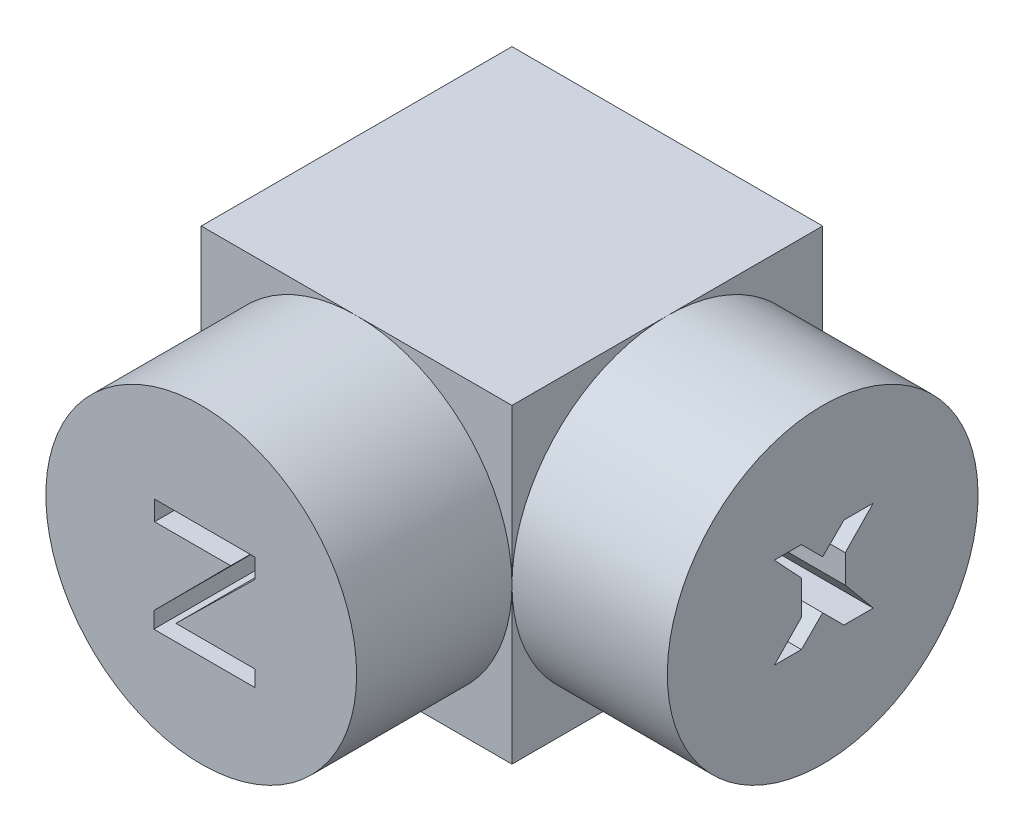
ISO-10303-21;
HEADER;
FILE_DESCRIPTION(('STEP AP214'),'2;1');
FILE_NAME('part.step','',(''),(''),'','','');
FILE_SCHEMA(('AUTOMOTIVE_DESIGN { 1 0 10303 214 1 1 1 1 }'));
ENDSEC;
DATA;
#1=APPLICATION_CONTEXT('core data for automotive mechanical design processes');
#2=APPLICATION_PROTOCOL_DEFINITION('international standard','automotive_design',2000,#1);
#3=PRODUCT_CONTEXT('',#1,'mechanical');
#4=PRODUCT('Part','Part','',(#3));
#5=PRODUCT_RELATED_PRODUCT_CATEGORY('part','',(#4));
#6=PRODUCT_DEFINITION_FORMATION('','',#4);
#7=PRODUCT_DEFINITION_CONTEXT('part definition',#1,'design');
#8=PRODUCT_DEFINITION('design','',#6,#7);
#9=PRODUCT_DEFINITION_SHAPE('','',#8);
#10=(LENGTH_UNIT() NAMED_UNIT(*) SI_UNIT(.MILLI.,.METRE.));
#11=(NAMED_UNIT(*) PLANE_ANGLE_UNIT() SI_UNIT($,.RADIAN.));
#12=(NAMED_UNIT(*) SI_UNIT($,.STERADIAN.) SOLID_ANGLE_UNIT());
#13=UNCERTAINTY_MEASURE_WITH_UNIT(LENGTH_MEASURE(1.E-05),#10,'distance_accuracy_value','');
#14=(GEOMETRIC_REPRESENTATION_CONTEXT(3) GLOBAL_UNCERTAINTY_ASSIGNED_CONTEXT((#13)) GLOBAL_UNIT_ASSIGNED_CONTEXT((#10,
#11,#12)) REPRESENTATION_CONTEXT('',''));
#15=CARTESIAN_POINT('',(0.,0.,0.));
#16=DIRECTION('',(0.,0.,1.));
#17=DIRECTION('',(1.,0.,0.));
#18=AXIS2_PLACEMENT_3D('',#15,#16,#17);
#19=CARTESIAN_POINT('',(0.025,0.0249999999999998,-0.025));
#20=DIRECTION('',(1.,0.,0.));
#21=DIRECTION('',(0.,1.,0.));
#22=AXIS2_PLACEMENT_3D('',#19,#20,#21);
#23=PLANE('',#22);
#24=DIRECTION('',(0.,0.,1.));
#25=VECTOR('',#24,1.);
#26=CARTESIAN_POINT('',(0.025,0.0249999999999998,-0.025));
#27=LINE('',#26,#25);
#28=CARTESIAN_POINT('',(0.025,0.0249999999999998,-0.025));
#29=VERTEX_POINT('',#28);
#30=CARTESIAN_POINT('',(0.025,0.0249999999999998,0.));
#31=VERTEX_POINT('',#30);
#32=EDGE_CURVE('E462',#29,#31,#27,.T.);
#33=ORIENTED_EDGE('',*,*,#32,.T.);
#34=CARTESIAN_POINT('',(0.025,0.,0.));
#35=DIRECTION('',(1.,0.,0.));
#36=DIRECTION('',(0.,1.,0.));
#37=AXIS2_PLACEMENT_3D('',#34,#35,#36);
#38=CIRCLE('',#37,0.0249999999999998);
#39=CARTESIAN_POINT('',(0.025,0.,-0.025));
#40=VERTEX_POINT('',#39);
#41=EDGE_CURVE('E254',#40,#31,#38,.T.);
#42=ORIENTED_EDGE('',*,*,#41,.F.);
#43=DIRECTION('',(0.,1.,0.));
#44=VECTOR('',#43,1.);
#45=CARTESIAN_POINT('',(0.025,0.0249999999999998,-0.025));
#46=LINE('',#45,#44);
#47=EDGE_CURVE('E452',#40,#29,#46,.T.);
#48=ORIENTED_EDGE('',*,*,#47,.T.);
#49=EDGE_LOOP('',(#33,#42,#48));
#50=FACE_BOUND('',#49,.T.);
#51=ADVANCED_FACE('F31',(#50),#23,.T.);
#52=CARTESIAN_POINT('',(0.025,-0.0249999999999998,-0.025));
#53=VERTEX_POINT('',#52);
#54=EDGE_CURVE('E453',#53,#40,#46,.T.);
#55=ORIENTED_EDGE('',*,*,#54,.T.);
#56=CARTESIAN_POINT('',(0.025,-0.0249999999999998,0.));
#57=VERTEX_POINT('',#56);
#58=EDGE_CURVE('E512',#57,#40,#38,.T.);
#59=ORIENTED_EDGE('',*,*,#58,.F.);
#60=DIRECTION('',(0.,0.,1.));
#61=VECTOR('',#60,1.);
#62=CARTESIAN_POINT('',(0.025,-0.0249999999999998,-0.025));
#63=LINE('',#62,#61);
#64=EDGE_CURVE('E465',#53,#57,#63,.T.);
#65=ORIENTED_EDGE('',*,*,#64,.F.);
#66=EDGE_LOOP('',(#55,#59,#65));
#67=FACE_BOUND('',#66,.T.);
#68=ADVANCED_FACE('F511',(#67),#23,.T.);
#69=CARTESIAN_POINT('',(0.025,-0.0249999999999998,0.025));
#70=VERTEX_POINT('',#69);
#71=EDGE_CURVE('E467',#57,#70,#63,.T.);
#72=ORIENTED_EDGE('',*,*,#71,.F.);
#73=CARTESIAN_POINT('',(0.0250011786662926,0.,0.0250011786662925));
#74=VERTEX_POINT('',#73);
#75=EDGE_CURVE('E353',#74,#57,#38,.T.);
#76=ORIENTED_EDGE('',*,*,#75,.F.);
#77=DIRECTION('',(0.,1.,0.));
#78=VECTOR('',#77,1.);
#79=CARTESIAN_POINT('',(0.025,0.0249999999999998,0.025));
#80=LINE('',#79,#78);
#81=EDGE_CURVE('E439',#70,#74,#80,.T.);
#82=ORIENTED_EDGE('',*,*,#81,.F.);
#83=EDGE_LOOP('',(#72,#76,#82));
#84=FACE_BOUND('',#83,.T.);
#85=ADVANCED_FACE('F517',(#84),#23,.T.);
#86=CARTESIAN_POINT('',(0.025,0.0249999999999998,0.025));
#87=VERTEX_POINT('',#86);
#88=EDGE_CURVE('E438',#74,#87,#80,.T.);
#89=ORIENTED_EDGE('',*,*,#88,.F.);
#90=EDGE_CURVE('E351',#31,#74,#38,.T.);
#91=ORIENTED_EDGE('',*,*,#90,.F.);
#92=EDGE_CURVE('E464',#31,#87,#27,.T.);
#93=ORIENTED_EDGE('',*,*,#92,.T.);
#94=EDGE_LOOP('',(#89,#91,#93));
#95=FACE_BOUND('',#94,.T.);
#96=ADVANCED_FACE('F500',(#95),#23,.T.);
#97=CARTESIAN_POINT('',(-0.025,-0.0249999999999998,0.025));
#98=DIRECTION('',(0.,0.,1.));
#99=DIRECTION('',(1.,0.,0.));
#100=AXIS2_PLACEMENT_3D('',#97,#98,#99);
#101=PLANE('',#100);
#102=CARTESIAN_POINT('',(0.,0.,0.025));
#103=DIRECTION('',(0.,0.,1.));
#104=DIRECTION('',(1.,0.,0.));
#105=AXIS2_PLACEMENT_3D('',#102,#103,#104);
#106=CIRCLE('',#105,0.0250047146651704);
#107=CARTESIAN_POINT('',(0.,0.0249999999999998,0.025));
#108=VERTEX_POINT('',#107);
#109=EDGE_CURVE('E42',#74,#108,#106,.T.);
#110=ORIENTED_EDGE('',*,*,#109,.F.);
#111=ORIENTED_EDGE('',*,*,#88,.T.);
#112=DIRECTION('',(-1.,0.,0.));
#113=VECTOR('',#112,1.);
#114=CARTESIAN_POINT('',(-0.025,0.0249999999999998,0.025));
#115=LINE('',#114,#113);
#116=EDGE_CURVE('E443',#87,#108,#115,.T.);
#117=ORIENTED_EDGE('',*,*,#116,.T.);
#118=EDGE_LOOP('',(#110,#111,#117));
#119=FACE_BOUND('',#118,.T.);
#120=ADVANCED_FACE('F496',(#119),#101,.T.);
#121=CARTESIAN_POINT('',(-0.025,0.,0.025));
#122=VERTEX_POINT('',#121);
#123=EDGE_CURVE('E11',#108,#122,#106,.T.);
#124=ORIENTED_EDGE('',*,*,#123,.F.);
#125=CARTESIAN_POINT('',(-0.025,0.0249999999999998,0.025));
#126=VERTEX_POINT('',#125);
#127=EDGE_CURVE('E442',#108,#126,#115,.T.);
#128=ORIENTED_EDGE('',*,*,#127,.T.);
#129=DIRECTION('',(0.,-1.,0.));
#130=VECTOR('',#129,1.);
#131=CARTESIAN_POINT('',(-0.025,0.0249999999999998,0.025));
#132=LINE('',#131,#130);
#133=EDGE_CURVE('E431',#126,#122,#132,.T.);
#134=ORIENTED_EDGE('',*,*,#133,.T.);
#135=EDGE_LOOP('',(#124,#128,#134));
#136=FACE_BOUND('',#135,.T.);
#137=ADVANCED_FACE('F489',(#136),#101,.T.);
#138=CARTESIAN_POINT('',(0.,-0.0249999999999998,0.025));
#139=VERTEX_POINT('',#138);
#140=EDGE_CURVE('E40',#122,#139,#106,.T.);
#141=ORIENTED_EDGE('',*,*,#140,.F.);
#142=CARTESIAN_POINT('',(-0.025,-0.0249999999999998,0.025));
#143=VERTEX_POINT('',#142);
#144=EDGE_CURVE('E427',#122,#143,#132,.T.);
#145=ORIENTED_EDGE('',*,*,#144,.T.);
#146=DIRECTION('',(1.,0.,0.));
#147=VECTOR('',#146,1.);
#148=CARTESIAN_POINT('',(-0.025,-0.0249999999999998,0.025));
#149=LINE('',#148,#147);
#150=EDGE_CURVE('E435',#143,#139,#149,.T.);
#151=ORIENTED_EDGE('',*,*,#150,.T.);
#152=EDGE_LOOP('',(#141,#145,#151));
#153=FACE_BOUND('',#152,.T.);
#154=ADVANCED_FACE('F482',(#153),#101,.T.);
#155=CARTESIAN_POINT('',(-0.025,0.0249999999999998,-0.025));
#156=DIRECTION('',(-1.,0.,0.));
#157=DIRECTION('',(0.,-1.,0.));
#158=AXIS2_PLACEMENT_3D('',#155,#156,#157);
#159=PLANE('',#158);
#160=DIRECTION('',(0.,0.,1.));
#161=VECTOR('',#160,1.);
#162=CARTESIAN_POINT('',(-0.025,-0.0249999999999998,-0.025));
#163=LINE('',#162,#161);
#164=CARTESIAN_POINT('',(-0.025,-0.0249999999999998,-0.025));
#165=VERTEX_POINT('',#164);
#166=EDGE_CURVE('E35',#165,#143,#163,.T.);
#167=ORIENTED_EDGE('',*,*,#166,.T.);
#168=ORIENTED_EDGE('',*,*,#144,.F.);
#169=ORIENTED_EDGE('',*,*,#133,.F.);
#170=DIRECTION('',(0.,0.,1.));
#171=VECTOR('',#170,1.);
#172=CARTESIAN_POINT('',(-0.025,0.0249999999999998,-0.025));
#173=LINE('',#172,#171);
#174=CARTESIAN_POINT('',(-0.025,0.0249999999999998,-0.025));
#175=VERTEX_POINT('',#174);
#176=EDGE_CURVE('E459',#175,#126,#173,.T.);
#177=ORIENTED_EDGE('',*,*,#176,.F.);
#178=DIRECTION('',(0.,-1.,0.));
#179=VECTOR('',#178,1.);
#180=CARTESIAN_POINT('',(-0.025,0.0249999999999998,-0.025));
#181=LINE('',#180,#179);
#182=EDGE_CURVE('E446',#175,#165,#181,.T.);
#183=ORIENTED_EDGE('',*,*,#182,.T.);
#184=EDGE_LOOP('',(#167,#168,#169,#177,#183));
#185=FACE_BOUND('',#184,.T.);
#186=ADVANCED_FACE('F33',(#185),#159,.T.);
#187=CARTESIAN_POINT('',(-0.025,0.0249999999999998,-0.025));
#188=DIRECTION('',(0.,1.,0.));
#189=DIRECTION('',(0.,0.,1.));
#190=AXIS2_PLACEMENT_3D('',#187,#188,#189);
#191=PLANE('',#190);
#192=ORIENTED_EDGE('',*,*,#176,.T.);
#193=ORIENTED_EDGE('',*,*,#127,.F.);
#194=ORIENTED_EDGE('',*,*,#116,.F.);
#195=ORIENTED_EDGE('',*,*,#92,.F.);
#196=ORIENTED_EDGE('',*,*,#32,.F.);
#197=DIRECTION('',(-1.,0.,0.));
#198=VECTOR('',#197,1.);
#199=CARTESIAN_POINT('',(-0.025,0.0249999999999998,-0.025));
#200=LINE('',#199,#198);
#201=EDGE_CURVE('E456',#29,#175,#200,.T.);
#202=ORIENTED_EDGE('',*,*,#201,.T.);
#203=EDGE_LOOP('',(#192,#193,#194,#195,#196,#202));
#204=FACE_BOUND('',#203,.T.);
#205=ADVANCED_FACE('F492',(#204),#191,.T.);
#206=CARTESIAN_POINT('',(-0.025,-0.0249999999999998,-0.025));
#207=DIRECTION('',(0.,-1.,0.));
#208=DIRECTION('',(0.,0.,-1.));
#209=AXIS2_PLACEMENT_3D('',#206,#207,#208);
#210=PLANE('',#209);
#211=ORIENTED_EDGE('',*,*,#64,.T.);
#212=ORIENTED_EDGE('',*,*,#71,.T.);
#213=EDGE_CURVE('E434',#139,#70,#149,.T.);
#214=ORIENTED_EDGE('',*,*,#213,.F.);
#215=ORIENTED_EDGE('',*,*,#150,.F.);
#216=ORIENTED_EDGE('',*,*,#166,.F.);
#217=DIRECTION('',(1.,0.,0.));
#218=VECTOR('',#217,1.);
#219=CARTESIAN_POINT('',(-0.025,-0.0249999999999998,-0.025));
#220=LINE('',#219,#218);
#221=EDGE_CURVE('E449',#165,#53,#220,.T.);
#222=ORIENTED_EDGE('',*,*,#221,.T.);
#223=EDGE_LOOP('',(#211,#212,#214,#215,#216,#222));
#224=FACE_BOUND('',#223,.T.);
#225=ADVANCED_FACE('F479',(#224),#210,.T.);
#226=CARTESIAN_POINT('',(-0.025,-0.0249999999999998,-0.025));
#227=DIRECTION('',(0.,0.,1.));
#228=DIRECTION('',(1.,0.,0.));
#229=AXIS2_PLACEMENT_3D('',#226,#227,#228);
#230=PLANE('',#229);
#231=ORIENTED_EDGE('',*,*,#182,.F.);
#232=ORIENTED_EDGE('',*,*,#201,.F.);
#233=ORIENTED_EDGE('',*,*,#47,.F.);
#234=ORIENTED_EDGE('',*,*,#54,.F.);
#235=ORIENTED_EDGE('',*,*,#221,.F.);
#236=EDGE_LOOP('',(#231,#232,#233,#234,#235));
#237=FACE_BOUND('',#236,.T.);
#238=ADVANCED_FACE('F508',(#237),#230,.F.);
#239=EDGE_CURVE('E430',#139,#74,#106,.T.);
#240=ORIENTED_EDGE('',*,*,#239,.F.);
#241=ORIENTED_EDGE('',*,*,#213,.T.);
#242=ORIENTED_EDGE('',*,*,#81,.T.);
#243=EDGE_LOOP('',(#240,#241,#242));
#244=FACE_BOUND('',#243,.T.);
#245=ADVANCED_FACE('F519',(#244),#101,.T.);
#246=CARTESIAN_POINT('',(0.,0.,0.05));
#247=DIRECTION('',(0.,0.,1.));
#248=DIRECTION('',(1.,0.,0.));
#249=AXIS2_PLACEMENT_3D('',#246,#247,#248);
#250=PLANE('',#249);
#251=CARTESIAN_POINT('',(0.,0.,0.05));
#252=DIRECTION('',(0.,0.,1.));
#253=DIRECTION('',(1.,0.,0.));
#254=AXIS2_PLACEMENT_3D('',#251,#252,#253);
#255=CIRCLE('',#254,0.0250047146651704);
#256=CARTESIAN_POINT('',(0.0250047146651704,0.,0.05));
#257=VERTEX_POINT('',#256);
#258=EDGE_CURVE('E425',#257,#257,#255,.T.);
#259=ORIENTED_EDGE('',*,*,#258,.T.);
#260=EDGE_LOOP('',(#259));
#261=FACE_BOUND('',#260,.T.);
#262=DIRECTION('',(1.,0.,0.));
#263=VECTOR('',#262,1.);
#264=CARTESIAN_POINT('',(0.00472598676449805,0.00502520446407785,0.05));
#265=LINE('',#264,#263);
#266=CARTESIAN_POINT('',(-0.00750978718742156,0.00502520446407785,0.05));
#267=VERTEX_POINT('',#266);
#268=CARTESIAN_POINT('',(0.00472598676449805,0.00502520446407785,0.05));
#269=VERTEX_POINT('',#268);
#270=EDGE_CURVE('E356',#267,#269,#265,.T.);
#271=ORIENTED_EDGE('',*,*,#270,.F.);
#272=DIRECTION('',(0.,-1.,0.));
#273=VECTOR('',#272,1.);
#274=CARTESIAN_POINT('',(-0.00750978718742156,0.00502520446407785,0.05));
#275=LINE('',#274,#273);
#276=CARTESIAN_POINT('',(-0.00750978718742156,0.00818955240697282,0.05));
#277=VERTEX_POINT('',#276);
#278=EDGE_CURVE('E354',#277,#267,#275,.T.);
#279=ORIENTED_EDGE('',*,*,#278,.F.);
#280=DIRECTION('',(-1.,0.,0.));
#281=VECTOR('',#280,1.);
#282=CARTESIAN_POINT('',(-0.00750978718742156,0.00818955240697282,0.05));
#283=LINE('',#282,#281);
#284=CARTESIAN_POINT('',(0.00861035944764713,0.00818955240697282,0.05));
#285=VERTEX_POINT('',#284);
#286=EDGE_CURVE('E374',#285,#277,#283,.T.);
#287=ORIENTED_EDGE('',*,*,#286,.F.);
#288=DIRECTION('',(0.,1.,0.));
#289=VECTOR('',#288,1.);
#290=CARTESIAN_POINT('',(0.00861035944764713,0.00818955240697282,0.05));
#291=LINE('',#290,#289);
#292=CARTESIAN_POINT('',(0.00861035944764713,0.00502520446407785,0.05));
#293=VERTEX_POINT('',#292);
#294=EDGE_CURVE('E371',#293,#285,#291,.T.);
#295=ORIENTED_EDGE('',*,*,#294,.F.);
#296=DIRECTION('',(0.714136574352268,0.700006395093936,0.));
#297=VECTOR('',#296,1.);
#298=CARTESIAN_POINT('',(0.00861035944764713,0.00502520446407785,0.05));
#299=LINE('',#298,#297);
#300=CARTESIAN_POINT('',(-0.00407859131730653,-0.00741267787034266,0.05));
#301=VERTEX_POINT('',#300);
#302=EDGE_CURVE('E369',#301,#293,#299,.T.);
#303=ORIENTED_EDGE('',*,*,#302,.F.);
#304=DIRECTION('',(-1.,0.,0.));
#305=VECTOR('',#304,1.);
#306=CARTESIAN_POINT('',(-0.00407859131730653,-0.00741267787034266,0.05));
#307=LINE('',#306,#305);
#308=CARTESIAN_POINT('',(0.00861035944764713,-0.00741267787034266,0.05));
#309=VERTEX_POINT('',#308);
#310=EDGE_CURVE('E367',#309,#301,#307,.T.);
#311=ORIENTED_EDGE('',*,*,#310,.F.);
#312=DIRECTION('',(0.,1.,0.));
#313=VECTOR('',#312,1.);
#314=CARTESIAN_POINT('',(0.00861035944764713,-0.00741267787034266,0.05));
#315=LINE('',#314,#313);
#316=CARTESIAN_POINT('',(0.00861035944764713,-0.0100022596591087,0.05));
#317=VERTEX_POINT('',#316);
#318=EDGE_CURVE('E365',#317,#309,#315,.T.);
#319=ORIENTED_EDGE('',*,*,#318,.F.);
#320=DIRECTION('',(1.,0.,0.));
#321=VECTOR('',#320,1.);
#322=CARTESIAN_POINT('',(0.00861035944764713,-0.0100022596591087,0.05));
#323=LINE('',#322,#321);
#324=CARTESIAN_POINT('',(-0.00763926627685986,-0.0100022596591087,0.05));
#325=VERTEX_POINT('',#324);
#326=EDGE_CURVE('E363',#325,#317,#323,.T.);
#327=ORIENTED_EDGE('',*,*,#326,.F.);
#328=DIRECTION('',(0.,-1.,0.));
#329=VECTOR('',#328,1.);
#330=CARTESIAN_POINT('',(-0.00763926627685986,-0.0100022596591087,0.05));
#331=LINE('',#330,#329);
#332=CARTESIAN_POINT('',(-0.00763926627685986,-0.00741267787034266,0.05));
#333=VERTEX_POINT('',#332);
#334=EDGE_CURVE('E361',#333,#325,#331,.T.);
#335=ORIENTED_EDGE('',*,*,#334,.F.);
#336=DIRECTION('',(-0.705033187011092,-0.709174312290697,0.));
#337=VECTOR('',#336,1.);
#338=CARTESIAN_POINT('',(-0.00763926627685986,-0.00741267787034266,0.05));
#339=LINE('',#338,#337);
#340=EDGE_CURVE('E359',#269,#333,#339,.T.);
#341=ORIENTED_EDGE('',*,*,#340,.F.);
#342=EDGE_LOOP('',(#271,#279,#287,#295,#303,#311,#319,#327,#335,#341));
#343=FACE_BOUND('',#342,.T.);
#344=ADVANCED_FACE('F521',(#261,#343),#250,.T.);
#345=CARTESIAN_POINT('',(0.,0.,0.05));
#346=DIRECTION('',(0.,0.,-1.));
#347=DIRECTION('',(-1.,0.,0.));
#348=AXIS2_PLACEMENT_3D('',#345,#346,#347);
#349=CYLINDRICAL_SURFACE('',#348,0.0250047146651704);
#350=ORIENTED_EDGE('',*,*,#258,.F.);
#351=EDGE_LOOP('',(#350));
#352=FACE_BOUND('',#351,.T.);
#353=ORIENTED_EDGE('',*,*,#109,.T.);
#354=ORIENTED_EDGE('',*,*,#123,.T.);
#355=ORIENTED_EDGE('',*,*,#140,.T.);
#356=ORIENTED_EDGE('',*,*,#239,.T.);
#357=EDGE_LOOP('',(#353,#354,#355,#356));
#358=FACE_BOUND('',#357,.T.);
#359=ADVANCED_FACE('F485',(#352,#358),#349,.T.);
#360=CARTESIAN_POINT('',(-0.00750978718742156,0.00502520446407785,0.05));
#361=DIRECTION('',(1.,0.,0.));
#362=DIRECTION('',(0.,0.,-1.));
#363=AXIS2_PLACEMENT_3D('',#360,#361,#362);
#364=PLANE('',#363);
#365=DIRECTION('',(0.,-1.,0.));
#366=VECTOR('',#365,1.);
#367=CARTESIAN_POINT('',(-0.00750978718742156,0.00502520446407785,0.025));
#368=LINE('',#367,#366);
#369=CARTESIAN_POINT('',(-0.00750978718742156,0.00818955240697282,0.025));
#370=VERTEX_POINT('',#369);
#371=CARTESIAN_POINT('',(-0.00750978718742156,0.00502520446407785,0.025));
#372=VERTEX_POINT('',#371);
#373=EDGE_CURVE('E350',#370,#372,#368,.T.);
#374=ORIENTED_EDGE('',*,*,#373,.F.);
#375=DIRECTION('',(0.,0.,-1.));
#376=VECTOR('',#375,1.);
#377=CARTESIAN_POINT('',(-0.00750978718742156,0.00818955240697282,0.05));
#378=LINE('',#377,#376);
#379=EDGE_CURVE('E376',#277,#370,#378,.T.);
#380=ORIENTED_EDGE('',*,*,#379,.F.);
#381=ORIENTED_EDGE('',*,*,#278,.T.);
#382=DIRECTION('',(0.,0.,-1.));
#383=VECTOR('',#382,1.);
#384=CARTESIAN_POINT('',(-0.00750978718742156,0.00502520446407785,0.05));
#385=LINE('',#384,#383);
#386=EDGE_CURVE('E422',#267,#372,#385,.T.);
#387=ORIENTED_EDGE('',*,*,#386,.T.);
#388=EDGE_LOOP('',(#374,#380,#381,#387));
#389=FACE_BOUND('',#388,.T.);
#390=ADVANCED_FACE('F665',(#389),#364,.T.);
#391=CARTESIAN_POINT('',(0.00472598676449805,0.00502520446407785,0.05));
#392=DIRECTION('',(0.,1.,0.));
#393=DIRECTION('',(0.,0.,1.));
#394=AXIS2_PLACEMENT_3D('',#391,#392,#393);
#395=PLANE('',#394);
#396=DIRECTION('',(1.,0.,0.));
#397=VECTOR('',#396,1.);
#398=CARTESIAN_POINT('',(0.00472598676449805,0.00502520446407785,0.025));
#399=LINE('',#398,#397);
#400=CARTESIAN_POINT('',(0.00472598676449805,0.00502520446407785,0.025));
#401=VERTEX_POINT('',#400);
#402=EDGE_CURVE('E379',#372,#401,#399,.T.);
#403=ORIENTED_EDGE('',*,*,#402,.F.);
#404=ORIENTED_EDGE('',*,*,#386,.F.);
#405=ORIENTED_EDGE('',*,*,#270,.T.);
#406=DIRECTION('',(0.,0.,-1.));
#407=VECTOR('',#406,1.);
#408=CARTESIAN_POINT('',(0.00472598676449805,0.00502520446407785,0.05));
#409=LINE('',#408,#407);
#410=EDGE_CURVE('E420',#269,#401,#409,.T.);
#411=ORIENTED_EDGE('',*,*,#410,.T.);
#412=EDGE_LOOP('',(#403,#404,#405,#411));
#413=FACE_BOUND('',#412,.T.);
#414=ADVANCED_FACE('F655',(#413),#395,.T.);
#415=CARTESIAN_POINT('',(-0.00763926627685986,-0.00741267787034266,0.05));
#416=DIRECTION('',(0.709174312290697,-0.705033187011092,0.));
#417=DIRECTION('',(0.705033187011092,0.709174312290697,0.));
#418=AXIS2_PLACEMENT_3D('',#415,#416,#417);
#419=PLANE('',#418);
#420=DIRECTION('',(-0.705033187011092,-0.709174312290697,0.));
#421=VECTOR('',#420,1.);
#422=CARTESIAN_POINT('',(-0.00763926627685986,-0.00741267787034266,0.025));
#423=LINE('',#422,#421);
#424=CARTESIAN_POINT('',(-0.00763926627685986,-0.00741267787034266,0.025));
#425=VERTEX_POINT('',#424);
#426=EDGE_CURVE('E382',#401,#425,#423,.T.);
#427=ORIENTED_EDGE('',*,*,#426,.F.);
#428=ORIENTED_EDGE('',*,*,#410,.F.);
#429=ORIENTED_EDGE('',*,*,#340,.T.);
#430=DIRECTION('',(0.,0.,-1.));
#431=VECTOR('',#430,1.);
#432=CARTESIAN_POINT('',(-0.00763926627685986,-0.00741267787034266,0.05));
#433=LINE('',#432,#431);
#434=EDGE_CURVE('E418',#333,#425,#433,.T.);
#435=ORIENTED_EDGE('',*,*,#434,.T.);
#436=EDGE_LOOP('',(#427,#428,#429,#435));
#437=FACE_BOUND('',#436,.T.);
#438=ADVANCED_FACE('F645',(#437),#419,.T.);
#439=CARTESIAN_POINT('',(-0.00763926627685986,-0.0100022596591087,0.05));
#440=DIRECTION('',(1.,0.,0.));
#441=DIRECTION('',(0.,0.,-1.));
#442=AXIS2_PLACEMENT_3D('',#439,#440,#441);
#443=PLANE('',#442);
#444=DIRECTION('',(0.,-1.,0.));
#445=VECTOR('',#444,1.);
#446=CARTESIAN_POINT('',(-0.00763926627685986,-0.0100022596591087,0.025));
#447=LINE('',#446,#445);
#448=CARTESIAN_POINT('',(-0.00763926627685986,-0.0100022596591087,0.025));
#449=VERTEX_POINT('',#448);
#450=EDGE_CURVE('E385',#425,#449,#447,.T.);
#451=ORIENTED_EDGE('',*,*,#450,.F.);
#452=ORIENTED_EDGE('',*,*,#434,.F.);
#453=ORIENTED_EDGE('',*,*,#334,.T.);
#454=DIRECTION('',(0.,0.,-1.));
#455=VECTOR('',#454,1.);
#456=CARTESIAN_POINT('',(-0.00763926627685986,-0.0100022596591087,0.05));
#457=LINE('',#456,#455);
#458=EDGE_CURVE('E416',#325,#449,#457,.T.);
#459=ORIENTED_EDGE('',*,*,#458,.T.);
#460=EDGE_LOOP('',(#451,#452,#453,#459));
#461=FACE_BOUND('',#460,.T.);
#462=ADVANCED_FACE('F635',(#461),#443,.T.);
#463=CARTESIAN_POINT('',(0.00861035944764713,-0.0100022596591087,0.05));
#464=DIRECTION('',(0.,1.,0.));
#465=DIRECTION('',(0.,0.,1.));
#466=AXIS2_PLACEMENT_3D('',#463,#464,#465);
#467=PLANE('',#466);
#468=DIRECTION('',(1.,0.,0.));
#469=VECTOR('',#468,1.);
#470=CARTESIAN_POINT('',(0.00861035944764713,-0.0100022596591087,0.025));
#471=LINE('',#470,#469);
#472=CARTESIAN_POINT('',(0.00861035944764713,-0.0100022596591087,0.025));
#473=VERTEX_POINT('',#472);
#474=EDGE_CURVE('E388',#449,#473,#471,.T.);
#475=ORIENTED_EDGE('',*,*,#474,.F.);
#476=ORIENTED_EDGE('',*,*,#458,.F.);
#477=ORIENTED_EDGE('',*,*,#326,.T.);
#478=DIRECTION('',(0.,0.,-1.));
#479=VECTOR('',#478,1.);
#480=CARTESIAN_POINT('',(0.00861035944764713,-0.0100022596591087,0.05));
#481=LINE('',#480,#479);
#482=EDGE_CURVE('E414',#317,#473,#481,.T.);
#483=ORIENTED_EDGE('',*,*,#482,.T.);
#484=EDGE_LOOP('',(#475,#476,#477,#483));
#485=FACE_BOUND('',#484,.T.);
#486=ADVANCED_FACE('F625',(#485),#467,.T.);
#487=CARTESIAN_POINT('',(0.00861035944764713,-0.00741267787034266,0.05));
#488=DIRECTION('',(-1.,0.,0.));
#489=DIRECTION('',(0.,0.,1.));
#490=AXIS2_PLACEMENT_3D('',#487,#488,#489);
#491=PLANE('',#490);
#492=DIRECTION('',(0.,1.,0.));
#493=VECTOR('',#492,1.);
#494=CARTESIAN_POINT('',(0.00861035944764713,-0.00741267787034266,0.025));
#495=LINE('',#494,#493);
#496=CARTESIAN_POINT('',(0.00861035944764713,-0.00741267787034266,0.025));
#497=VERTEX_POINT('',#496);
#498=EDGE_CURVE('E391',#473,#497,#495,.T.);
#499=ORIENTED_EDGE('',*,*,#498,.F.);
#500=ORIENTED_EDGE('',*,*,#482,.F.);
#501=ORIENTED_EDGE('',*,*,#318,.T.);
#502=DIRECTION('',(0.,0.,-1.));
#503=VECTOR('',#502,1.);
#504=CARTESIAN_POINT('',(0.00861035944764713,-0.00741267787034266,0.05));
#505=LINE('',#504,#503);
#506=EDGE_CURVE('E412',#309,#497,#505,.T.);
#507=ORIENTED_EDGE('',*,*,#506,.T.);
#508=EDGE_LOOP('',(#499,#500,#501,#507));
#509=FACE_BOUND('',#508,.T.);
#510=ADVANCED_FACE('F615',(#509),#491,.T.);
#511=CARTESIAN_POINT('',(-0.00407859131730653,-0.00741267787034266,0.05));
#512=DIRECTION('',(0.,-1.,0.));
#513=DIRECTION('',(0.,0.,-1.));
#514=AXIS2_PLACEMENT_3D('',#511,#512,#513);
#515=PLANE('',#514);
#516=DIRECTION('',(-1.,0.,0.));
#517=VECTOR('',#516,1.);
#518=CARTESIAN_POINT('',(-0.00407859131730653,-0.00741267787034266,0.025));
#519=LINE('',#518,#517);
#520=CARTESIAN_POINT('',(-0.00407859131730653,-0.00741267787034266,0.025));
#521=VERTEX_POINT('',#520);
#522=EDGE_CURVE('E394',#497,#521,#519,.T.);
#523=ORIENTED_EDGE('',*,*,#522,.F.);
#524=ORIENTED_EDGE('',*,*,#506,.F.);
#525=ORIENTED_EDGE('',*,*,#310,.T.);
#526=DIRECTION('',(0.,0.,-1.));
#527=VECTOR('',#526,1.);
#528=CARTESIAN_POINT('',(-0.00407859131730653,-0.00741267787034266,0.05));
#529=LINE('',#528,#527);
#530=EDGE_CURVE('E410',#301,#521,#529,.T.);
#531=ORIENTED_EDGE('',*,*,#530,.T.);
#532=EDGE_LOOP('',(#523,#524,#525,#531));
#533=FACE_BOUND('',#532,.T.);
#534=ADVANCED_FACE('F605',(#533),#515,.T.);
#535=CARTESIAN_POINT('',(0.00861035944764713,0.00502520446407785,0.05));
#536=DIRECTION('',(-0.700006395093936,0.714136574352268,0.));
#537=DIRECTION('',(-0.714136574352268,-0.700006395093936,0.));
#538=AXIS2_PLACEMENT_3D('',#535,#536,#537);
#539=PLANE('',#538);
#540=DIRECTION('',(0.714136574352268,0.700006395093936,0.));
#541=VECTOR('',#540,1.);
#542=CARTESIAN_POINT('',(0.00861035944764713,0.00502520446407785,0.025));
#543=LINE('',#542,#541);
#544=CARTESIAN_POINT('',(0.00861035944764713,0.00502520446407785,0.025));
#545=VERTEX_POINT('',#544);
#546=EDGE_CURVE('E397',#521,#545,#543,.T.);
#547=ORIENTED_EDGE('',*,*,#546,.F.);
#548=ORIENTED_EDGE('',*,*,#530,.F.);
#549=ORIENTED_EDGE('',*,*,#302,.T.);
#550=DIRECTION('',(0.,0.,-1.));
#551=VECTOR('',#550,1.);
#552=CARTESIAN_POINT('',(0.00861035944764713,0.00502520446407785,0.05));
#553=LINE('',#552,#551);
#554=EDGE_CURVE('E408',#293,#545,#553,.T.);
#555=ORIENTED_EDGE('',*,*,#554,.T.);
#556=EDGE_LOOP('',(#547,#548,#549,#555));
#557=FACE_BOUND('',#556,.T.);
#558=ADVANCED_FACE('F595',(#557),#539,.T.);
#559=CARTESIAN_POINT('',(0.00861035944764713,0.00818955240697282,0.05));
#560=DIRECTION('',(-1.,0.,0.));
#561=DIRECTION('',(0.,0.,1.));
#562=AXIS2_PLACEMENT_3D('',#559,#560,#561);
#563=PLANE('',#562);
#564=DIRECTION('',(0.,1.,0.));
#565=VECTOR('',#564,1.);
#566=CARTESIAN_POINT('',(0.00861035944764713,0.00818955240697282,0.025));
#567=LINE('',#566,#565);
#568=CARTESIAN_POINT('',(0.00861035944764713,0.00818955240697282,0.025));
#569=VERTEX_POINT('',#568);
#570=EDGE_CURVE('E400',#545,#569,#567,.T.);
#571=ORIENTED_EDGE('',*,*,#570,.F.);
#572=ORIENTED_EDGE('',*,*,#554,.F.);
#573=ORIENTED_EDGE('',*,*,#294,.T.);
#574=DIRECTION('',(0.,0.,-1.));
#575=VECTOR('',#574,1.);
#576=CARTESIAN_POINT('',(0.00861035944764713,0.00818955240697282,0.05));
#577=LINE('',#576,#575);
#578=EDGE_CURVE('E406',#285,#569,#577,.T.);
#579=ORIENTED_EDGE('',*,*,#578,.T.);
#580=EDGE_LOOP('',(#571,#572,#573,#579));
#581=FACE_BOUND('',#580,.T.);
#582=ADVANCED_FACE('F584',(#581),#563,.T.);
#583=CARTESIAN_POINT('',(-0.00750978718742156,0.00818955240697282,0.05));
#584=DIRECTION('',(0.,-1.,0.));
#585=DIRECTION('',(0.,0.,-1.));
#586=AXIS2_PLACEMENT_3D('',#583,#584,#585);
#587=PLANE('',#586);
#588=DIRECTION('',(-1.,0.,0.));
#589=VECTOR('',#588,1.);
#590=CARTESIAN_POINT('',(-0.00750978718742156,0.00818955240697282,0.025));
#591=LINE('',#590,#589);
#592=EDGE_CURVE('E357',#569,#370,#591,.T.);
#593=ORIENTED_EDGE('',*,*,#592,.F.);
#594=ORIENTED_EDGE('',*,*,#578,.F.);
#595=ORIENTED_EDGE('',*,*,#286,.T.);
#596=ORIENTED_EDGE('',*,*,#379,.T.);
#597=EDGE_LOOP('',(#593,#594,#595,#596));
#598=FACE_BOUND('',#597,.T.);
#599=ADVANCED_FACE('F534',(#598),#587,.T.);
#600=ORIENTED_EDGE('',*,*,#592,.T.);
#601=ORIENTED_EDGE('',*,*,#373,.T.);
#602=ORIENTED_EDGE('',*,*,#402,.T.);
#603=ORIENTED_EDGE('',*,*,#426,.T.);
#604=ORIENTED_EDGE('',*,*,#450,.T.);
#605=ORIENTED_EDGE('',*,*,#474,.T.);
#606=ORIENTED_EDGE('',*,*,#498,.T.);
#607=ORIENTED_EDGE('',*,*,#522,.T.);
#608=ORIENTED_EDGE('',*,*,#546,.T.);
#609=ORIENTED_EDGE('',*,*,#570,.T.);
#610=EDGE_LOOP('',(#600,#601,#602,#603,#604,#605,#606,#607,#608,#609));
#611=FACE_BOUND('',#610,.T.);
#612=ADVANCED_FACE('F523',(#611),#101,.T.);
#613=CARTESIAN_POINT('',(0.05,0.,0.));
#614=DIRECTION('',(1.,0.,0.));
#615=DIRECTION('',(0.,1.,0.));
#616=AXIS2_PLACEMENT_3D('',#613,#614,#615);
#617=PLANE('',#616);
#618=CARTESIAN_POINT('',(0.05,0.,0.));
#619=DIRECTION('',(1.,0.,0.));
#620=DIRECTION('',(0.,1.,0.));
#621=AXIS2_PLACEMENT_3D('',#618,#619,#620);
#622=CIRCLE('',#621,0.0249999999999998);
#623=CARTESIAN_POINT('',(0.05,0.0249999999999999,0.));
#624=VERTEX_POINT('',#623);
#625=EDGE_CURVE('E347',#624,#624,#622,.T.);
#626=ORIENTED_EDGE('',*,*,#625,.T.);
#627=EDGE_LOOP('',(#626));
#628=FACE_BOUND('',#627,.T.);
#629=DIRECTION('',(0.,-1.,0.));
#630=VECTOR('',#629,1.);
#631=CARTESIAN_POINT('',(0.05,-0.00281896576653196,0.00342027885313942));
#632=LINE('',#631,#630);
#633=CARTESIAN_POINT('',(0.05,0.00266388512986437,0.00342027885313942));
#634=VERTEX_POINT('',#633);
#635=CARTESIAN_POINT('',(0.05,-0.00281896576653196,0.00342027885313942));
#636=VERTEX_POINT('',#635);
#637=EDGE_CURVE('E248',#634,#636,#632,.T.);
#638=ORIENTED_EDGE('',*,*,#637,.F.);
#639=DIRECTION('',(0.,-0.730271413518862,-0.683157128775777));
#640=VECTOR('',#639,1.);
#641=CARTESIAN_POINT('',(0.05,0.00266388512986437,0.00342027885313942));
#642=LINE('',#641,#640);
#643=CARTESIAN_POINT('',(0.05,0.00731630422990842,0.00777254188221331));
#644=VERTEX_POINT('',#643);
#645=EDGE_CURVE('E239',#644,#634,#642,.T.);
#646=ORIENTED_EDGE('',*,*,#645,.F.);
#647=DIRECTION('',(0.,0.,1.));
#648=VECTOR('',#647,1.);
#649=CARTESIAN_POINT('',(0.05,0.00731630422990842,0.00777254188221331));
#650=LINE('',#649,#648);
#651=CARTESIAN_POINT('',(0.05,0.00731630422990842,0.00342027885313942));
#652=VERTEX_POINT('',#651);
#653=EDGE_CURVE('E285',#652,#644,#650,.T.);
#654=ORIENTED_EDGE('',*,*,#653,.F.);
#655=DIRECTION('',(0.,0.707106781186547,0.707106781186548));
#656=VECTOR('',#655,1.);
#657=CARTESIAN_POINT('',(0.05,0.00731630422990842,0.00342027885313942));
#658=LINE('',#657,#656);
#659=CARTESIAN_POINT('',(0.05,0.0038960253767695,0.));
#660=VERTEX_POINT('',#659);
#661=EDGE_CURVE('E282',#660,#652,#658,.T.);
#662=ORIENTED_EDGE('',*,*,#661,.F.);
#663=DIRECTION('',(0.,-0.707106781186548,0.707106781186547));
#664=VECTOR('',#663,1.);
#665=CARTESIAN_POINT('',(0.05,0.0038960253767695,0.));
#666=LINE('',#665,#664);
#667=CARTESIAN_POINT('',(0.05,0.00731630422990839,-0.00342027885313839));
#668=VERTEX_POINT('',#667);
#669=EDGE_CURVE('E280',#668,#660,#666,.T.);
#670=ORIENTED_EDGE('',*,*,#669,.F.);
#671=DIRECTION('',(0.,0.,1.));
#672=VECTOR('',#671,1.);
#673=CARTESIAN_POINT('',(0.05,0.00731630422990839,-0.00342027885313839));
#674=LINE('',#673,#672);
#675=CARTESIAN_POINT('',(0.05,0.00731630422990839,-0.00813572987922905));
#676=VERTEX_POINT('',#675);
#677=EDGE_CURVE('E278',#676,#668,#674,.T.);
#678=ORIENTED_EDGE('',*,*,#677,.F.);
#679=DIRECTION('',(0.,0.718602141766599,-0.695421427516047));
#680=VECTOR('',#679,1.);
#681=CARTESIAN_POINT('',(0.05,0.00266388512986437,-0.00363338881467044));
#682=LINE('',#681,#680);
#683=CARTESIAN_POINT('',(0.05,0.00266388512986437,-0.00363338881467044));
#684=VERTEX_POINT('',#683);
#685=EDGE_CURVE('E276',#684,#676,#682,.T.);
#686=ORIENTED_EDGE('',*,*,#685,.F.);
#687=DIRECTION('',(0.,1.,0.));
#688=VECTOR('',#687,1.);
#689=CARTESIAN_POINT('',(0.05,-0.00187107853761025,-0.00363338881467044));
#690=LINE('',#689,#688);
#691=CARTESIAN_POINT('',(0.05,-0.00187107853761025,-0.00363338881467044));
#692=VERTEX_POINT('',#691);
#693=EDGE_CURVE('E274',#692,#684,#690,.T.);
#694=ORIENTED_EDGE('',*,*,#693,.F.);
#695=DIRECTION('',(0.,0.770675974119328,0.637227230205383));
#696=VECTOR('',#695,1.);
#697=CARTESIAN_POINT('',(0.05,-0.00731630422990792,-0.00813572987922888));
#698=LINE('',#697,#696);
#699=CARTESIAN_POINT('',(0.05,-0.00731630422990792,-0.00813572987922888));
#700=VERTEX_POINT('',#699);
#701=EDGE_CURVE('E272',#700,#692,#698,.T.);
#702=ORIENTED_EDGE('',*,*,#701,.F.);
#703=DIRECTION('',(0.,0.,-1.));
#704=VECTOR('',#703,1.);
#705=CARTESIAN_POINT('',(0.05,-0.00731630422990792,-0.00813572987922888));
#706=LINE('',#705,#704);
#707=CARTESIAN_POINT('',(0.05,-0.00731630422990792,-0.00342027885313826));
#708=VERTEX_POINT('',#707);
#709=EDGE_CURVE('E270',#708,#700,#706,.T.);
#710=ORIENTED_EDGE('',*,*,#709,.F.);
#711=DIRECTION('',(0.,-0.707106781186547,-0.707106781186548));
#712=VECTOR('',#711,1.);
#713=CARTESIAN_POINT('',(0.05,-0.00731630422990792,-0.00342027885313826));
#714=LINE('',#713,#712);
#715=CARTESIAN_POINT('',(0.05,-0.00389602537676926,0.));
#716=VERTEX_POINT('',#715);
#717=EDGE_CURVE('E268',#716,#708,#714,.T.);
#718=ORIENTED_EDGE('',*,*,#717,.F.);
#719=DIRECTION('',(0.,0.707106781186548,-0.707106781186547));
#720=VECTOR('',#719,1.);
#721=CARTESIAN_POINT('',(0.05,-0.00389602537676926,0.));
#722=LINE('',#721,#720);
#723=CARTESIAN_POINT('',(0.05,-0.00731630422990809,0.00342027885313923));
#724=VERTEX_POINT('',#723);
#725=EDGE_CURVE('E266',#724,#716,#722,.T.);
#726=ORIENTED_EDGE('',*,*,#725,.F.);
#727=DIRECTION('',(0.,0.,-1.));
#728=VECTOR('',#727,1.);
#729=CARTESIAN_POINT('',(0.05,-0.00731630422990809,0.00342027885313923));
#730=LINE('',#729,#728);
#731=CARTESIAN_POINT('',(0.05,-0.00731630422990809,0.00777254188221299));
#732=VERTEX_POINT('',#731);
#733=EDGE_CURVE('E262',#732,#724,#730,.T.);
#734=ORIENTED_EDGE('',*,*,#733,.F.);
#735=DIRECTION('',(0.,-0.718602141766599,0.695421427516047));
#736=VECTOR('',#735,1.);
#737=CARTESIAN_POINT('',(0.05,-0.00731630422990809,0.00777254188221299));
#738=LINE('',#737,#736);
#739=EDGE_CURVE('E260',#636,#732,#738,.T.);
#740=ORIENTED_EDGE('',*,*,#739,.F.);
#741=EDGE_LOOP('',(#638,#646,#654,#662,#670,#678,#686,#694,#702,#710,#718,#726,#734,#740));
#742=FACE_BOUND('',#741,.T.);
#743=ADVANCED_FACE('F258',(#628,#742),#617,.T.);
#744=CARTESIAN_POINT('',(0.05,0.,0.));
#745=DIRECTION('',(-1.,0.,0.));
#746=DIRECTION('',(0.,-1.,0.));
#747=AXIS2_PLACEMENT_3D('',#744,#745,#746);
#748=CYLINDRICAL_SURFACE('',#747,0.0249999999999998);
#749=ORIENTED_EDGE('',*,*,#625,.F.);
#750=EDGE_LOOP('',(#749));
#751=FACE_BOUND('',#750,.T.);
#752=ORIENTED_EDGE('',*,*,#90,.T.);
#753=ORIENTED_EDGE('',*,*,#75,.T.);
#754=ORIENTED_EDGE('',*,*,#58,.T.);
#755=ORIENTED_EDGE('',*,*,#41,.T.);
#756=EDGE_LOOP('',(#752,#753,#754,#755));
#757=FACE_BOUND('',#756,.T.);
#758=ADVANCED_FACE('F747',(#751,#757),#748,.T.);
#759=CARTESIAN_POINT('',(0.05,0.00266388512986437,0.00342027885313942));
#760=DIRECTION('',(0.,0.683157128775777,-0.730271413518862));
#761=DIRECTION('',(0.,0.730271413518862,0.683157128775777));
#762=AXIS2_PLACEMENT_3D('',#759,#760,#761);
#763=PLANE('',#762);
#764=DIRECTION('',(0.,-0.730271413518862,-0.683157128775777));
#765=VECTOR('',#764,1.);
#766=CARTESIAN_POINT('',(0.025,0.00266388512986437,0.00342027885313942));
#767=LINE('',#766,#765);
#768=CARTESIAN_POINT('',(0.025,0.00731630422990842,0.00777254188221331));
#769=VERTEX_POINT('',#768);
#770=CARTESIAN_POINT('',(0.025,0.00266388512986437,0.00342027885313941));
#771=VERTEX_POINT('',#770);
#772=EDGE_CURVE('E49',#769,#771,#767,.T.);
#773=ORIENTED_EDGE('',*,*,#772,.F.);
#774=DIRECTION('',(-1.,0.,0.));
#775=VECTOR('',#774,1.);
#776=CARTESIAN_POINT('',(0.05,0.00731630422990842,0.00777254188221331));
#777=LINE('',#776,#775);
#778=EDGE_CURVE('E244',#644,#769,#777,.T.);
#779=ORIENTED_EDGE('',*,*,#778,.F.);
#780=ORIENTED_EDGE('',*,*,#645,.T.);
#781=DIRECTION('',(-1.,0.,0.));
#782=VECTOR('',#781,1.);
#783=CARTESIAN_POINT('',(0.05,0.00266388512986437,0.00342027885313942));
#784=LINE('',#783,#782);
#785=EDGE_CURVE('E242',#634,#771,#784,.T.);
#786=ORIENTED_EDGE('',*,*,#785,.T.);
#787=EDGE_LOOP('',(#773,#779,#780,#786));
#788=FACE_BOUND('',#787,.T.);
#789=ADVANCED_FACE('F241',(#788),#763,.T.);
#790=CARTESIAN_POINT('',(0.05,-0.00281896576653196,0.00342027885313942));
#791=DIRECTION('',(0.,0.,-1.));
#792=DIRECTION('',(0.,1.,0.));
#793=AXIS2_PLACEMENT_3D('',#790,#791,#792);
#794=PLANE('',#793);
#795=DIRECTION('',(0.,-1.,0.));
#796=VECTOR('',#795,1.);
#797=CARTESIAN_POINT('',(0.025,-0.00281896576653196,0.00342027885313942));
#798=LINE('',#797,#796);
#799=CARTESIAN_POINT('',(0.025,-0.00281896576653196,0.00342027885313941));
#800=VERTEX_POINT('',#799);
#801=EDGE_CURVE('E53',#771,#800,#798,.T.);
#802=ORIENTED_EDGE('',*,*,#801,.F.);
#803=ORIENTED_EDGE('',*,*,#785,.F.);
#804=ORIENTED_EDGE('',*,*,#637,.T.);
#805=DIRECTION('',(-1.,0.,0.));
#806=VECTOR('',#805,1.);
#807=CARTESIAN_POINT('',(0.05,-0.00281896576653196,0.00342027885313942));
#808=LINE('',#807,#806);
#809=EDGE_CURVE('E255',#636,#800,#808,.T.);
#810=ORIENTED_EDGE('',*,*,#809,.T.);
#811=EDGE_LOOP('',(#802,#803,#804,#810));
#812=FACE_BOUND('',#811,.T.);
#813=ADVANCED_FACE('F252',(#812),#794,.T.);
#814=CARTESIAN_POINT('',(0.05,-0.00731630422990809,0.00777254188221299));
#815=DIRECTION('',(0.,-0.695421427516047,-0.718602141766599));
#816=DIRECTION('',(0.,0.718602141766599,-0.695421427516047));
#817=AXIS2_PLACEMENT_3D('',#814,#815,#816);
#818=PLANE('',#817);
#819=DIRECTION('',(0.,-0.718602141766599,0.695421427516047));
#820=VECTOR('',#819,1.);
#821=CARTESIAN_POINT('',(0.025,-0.0073163042299081,0.00777254188221299));
#822=LINE('',#821,#820);
#823=CARTESIAN_POINT('',(0.025,-0.0073163042299081,0.00777254188221299));
#824=VERTEX_POINT('',#823);
#825=EDGE_CURVE('E289',#800,#824,#822,.T.);
#826=ORIENTED_EDGE('',*,*,#825,.F.);
#827=ORIENTED_EDGE('',*,*,#809,.F.);
#828=ORIENTED_EDGE('',*,*,#739,.T.);
#829=DIRECTION('',(-1.,0.,0.));
#830=VECTOR('',#829,1.);
#831=CARTESIAN_POINT('',(0.05,-0.00731630422990809,0.00777254188221299));
#832=LINE('',#831,#830);
#833=EDGE_CURVE('E343',#732,#824,#832,.T.);
#834=ORIENTED_EDGE('',*,*,#833,.T.);
#835=EDGE_LOOP('',(#826,#827,#828,#834));
#836=FACE_BOUND('',#835,.T.);
#837=ADVANCED_FACE('F774',(#836),#818,.T.);
#838=CARTESIAN_POINT('',(0.05,-0.00731630422990809,0.00342027885313923));
#839=DIRECTION('',(0.,1.,0.));
#840=DIRECTION('',(-1.,0.,0.));
#841=AXIS2_PLACEMENT_3D('',#838,#839,#840);
#842=PLANE('',#841);
#843=DIRECTION('',(0.,0.,-1.));
#844=VECTOR('',#843,1.);
#845=CARTESIAN_POINT('',(0.025,-0.0073163042299081,0.00342027885313923));
#846=LINE('',#845,#844);
#847=CARTESIAN_POINT('',(0.025,-0.0073163042299081,0.00342027885313923));
#848=VERTEX_POINT('',#847);
#849=EDGE_CURVE('E291',#824,#848,#846,.T.);
#850=ORIENTED_EDGE('',*,*,#849,.F.);
#851=ORIENTED_EDGE('',*,*,#833,.F.);
#852=ORIENTED_EDGE('',*,*,#733,.T.);
#853=DIRECTION('',(-1.,0.,0.));
#854=VECTOR('',#853,1.);
#855=CARTESIAN_POINT('',(0.05,-0.00731630422990809,0.00342027885313923));
#856=LINE('',#855,#854);
#857=EDGE_CURVE('E340',#724,#848,#856,.T.);
#858=ORIENTED_EDGE('',*,*,#857,.T.);
#859=EDGE_LOOP('',(#850,#851,#852,#858));
#860=FACE_BOUND('',#859,.T.);
#861=ADVANCED_FACE('F783',(#860),#842,.T.);
#862=CARTESIAN_POINT('',(0.05,-0.00389602537676926,0.));
#863=DIRECTION('',(0.,0.707106781186547,0.707106781186548));
#864=DIRECTION('',(0.,-0.707106781186548,0.707106781186547));
#865=AXIS2_PLACEMENT_3D('',#862,#863,#864);
#866=PLANE('',#865);
#867=DIRECTION('',(0.,0.707106781186548,-0.707106781186547));
#868=VECTOR('',#867,1.);
#869=CARTESIAN_POINT('',(0.025,-0.00389602537676926,0.));
#870=LINE('',#869,#868);
#871=CARTESIAN_POINT('',(0.025,-0.00389602537676926,0.));
#872=VERTEX_POINT('',#871);
#873=EDGE_CURVE('E293',#848,#872,#870,.T.);
#874=ORIENTED_EDGE('',*,*,#873,.F.);
#875=ORIENTED_EDGE('',*,*,#857,.F.);
#876=ORIENTED_EDGE('',*,*,#725,.T.);
#877=DIRECTION('',(-1.,0.,0.));
#878=VECTOR('',#877,1.);
#879=CARTESIAN_POINT('',(0.05,-0.00389602537676926,0.));
#880=LINE('',#879,#878);
#881=EDGE_CURVE('E337',#716,#872,#880,.T.);
#882=ORIENTED_EDGE('',*,*,#881,.T.);
#883=EDGE_LOOP('',(#874,#875,#876,#882));
#884=FACE_BOUND('',#883,.T.);
#885=ADVANCED_FACE('F793',(#884),#866,.T.);
#886=CARTESIAN_POINT('',(0.05,-0.00731630422990792,-0.00342027885313826));
#887=DIRECTION('',(0.,0.707106781186548,-0.707106781186547));
#888=DIRECTION('',(0.,0.707106781186547,0.707106781186548));
#889=AXIS2_PLACEMENT_3D('',#886,#887,#888);
#890=PLANE('',#889);
#891=DIRECTION('',(0.,-0.707106781186547,-0.707106781186548));
#892=VECTOR('',#891,1.);
#893=CARTESIAN_POINT('',(0.025,-0.00731630422990793,-0.00342027885313826));
#894=LINE('',#893,#892);
#895=CARTESIAN_POINT('',(0.025,-0.00731630422990793,-0.00342027885313826));
#896=VERTEX_POINT('',#895);
#897=EDGE_CURVE('E295',#872,#896,#894,.T.);
#898=ORIENTED_EDGE('',*,*,#897,.F.);
#899=ORIENTED_EDGE('',*,*,#881,.F.);
#900=ORIENTED_EDGE('',*,*,#717,.T.);
#901=DIRECTION('',(-1.,0.,0.));
#902=VECTOR('',#901,1.);
#903=CARTESIAN_POINT('',(0.05,-0.00731630422990792,-0.00342027885313826));
#904=LINE('',#903,#902);
#905=EDGE_CURVE('E334',#708,#896,#904,.T.);
#906=ORIENTED_EDGE('',*,*,#905,.T.);
#907=EDGE_LOOP('',(#898,#899,#900,#906));
#908=FACE_BOUND('',#907,.T.);
#909=ADVANCED_FACE('F803',(#908),#890,.T.);
#910=CARTESIAN_POINT('',(0.05,-0.00731630422990792,-0.00813572987922888));
#911=DIRECTION('',(0.,1.,0.));
#912=DIRECTION('',(0.,0.,1.));
#913=AXIS2_PLACEMENT_3D('',#910,#911,#912);
#914=PLANE('',#913);
#915=DIRECTION('',(0.,0.,-1.));
#916=VECTOR('',#915,1.);
#917=CARTESIAN_POINT('',(0.025,-0.00731630422990792,-0.00813572987922888));
#918=LINE('',#917,#916);
#919=CARTESIAN_POINT('',(0.025,-0.00731630422990792,-0.00813572987922889));
#920=VERTEX_POINT('',#919);
#921=EDGE_CURVE('E297',#896,#920,#918,.T.);
#922=ORIENTED_EDGE('',*,*,#921,.F.);
#923=ORIENTED_EDGE('',*,*,#905,.F.);
#924=ORIENTED_EDGE('',*,*,#709,.T.);
#925=DIRECTION('',(-1.,0.,0.));
#926=VECTOR('',#925,1.);
#927=CARTESIAN_POINT('',(0.05,-0.00731630422990792,-0.00813572987922888));
#928=LINE('',#927,#926);
#929=EDGE_CURVE('E331',#700,#920,#928,.T.);
#930=ORIENTED_EDGE('',*,*,#929,.T.);
#931=EDGE_LOOP('',(#922,#923,#924,#930));
#932=FACE_BOUND('',#931,.T.);
#933=ADVANCED_FACE('F813',(#932),#914,.T.);
#934=CARTESIAN_POINT('',(0.05,-0.00731630422990792,-0.00813572987922888));
#935=DIRECTION('',(0.,-0.637227230205383,0.770675974119328));
#936=DIRECTION('',(0.,-0.770675974119328,-0.637227230205383));
#937=AXIS2_PLACEMENT_3D('',#934,#935,#936);
#938=PLANE('',#937);
#939=DIRECTION('',(0.,0.770675974119328,0.637227230205383));
#940=VECTOR('',#939,1.);
#941=CARTESIAN_POINT('',(0.025,-0.00731630422990792,-0.00813572987922888));
#942=LINE('',#941,#940);
#943=CARTESIAN_POINT('',(0.025,-0.00187107853761026,-0.00363338881467044));
#944=VERTEX_POINT('',#943);
#945=EDGE_CURVE('E299',#920,#944,#942,.T.);
#946=ORIENTED_EDGE('',*,*,#945,.F.);
#947=ORIENTED_EDGE('',*,*,#929,.F.);
#948=ORIENTED_EDGE('',*,*,#701,.T.);
#949=DIRECTION('',(-1.,0.,0.));
#950=VECTOR('',#949,1.);
#951=CARTESIAN_POINT('',(0.05,-0.00187107853761025,-0.00363338881467044));
#952=LINE('',#951,#950);
#953=EDGE_CURVE('E328',#692,#944,#952,.T.);
#954=ORIENTED_EDGE('',*,*,#953,.T.);
#955=EDGE_LOOP('',(#946,#947,#948,#954));
#956=FACE_BOUND('',#955,.T.);
#957=ADVANCED_FACE('F823',(#956),#938,.T.);
#958=CARTESIAN_POINT('',(0.05,-0.00187107853761025,-0.00363338881467044));
#959=DIRECTION('',(0.,0.,1.));
#960=DIRECTION('',(1.,0.,0.));
#961=AXIS2_PLACEMENT_3D('',#958,#959,#960);
#962=PLANE('',#961);
#963=DIRECTION('',(0.,1.,0.));
#964=VECTOR('',#963,1.);
#965=CARTESIAN_POINT('',(0.025,-0.00187107853761026,-0.00363338881467044));
#966=LINE('',#965,#964);
#967=CARTESIAN_POINT('',(0.025,0.00266388512986437,-0.00363338881467044));
#968=VERTEX_POINT('',#967);
#969=EDGE_CURVE('E301',#944,#968,#966,.T.);
#970=ORIENTED_EDGE('',*,*,#969,.F.);
#971=ORIENTED_EDGE('',*,*,#953,.F.);
#972=ORIENTED_EDGE('',*,*,#693,.T.);
#973=DIRECTION('',(-1.,0.,0.));
#974=VECTOR('',#973,1.);
#975=CARTESIAN_POINT('',(0.05,0.00266388512986437,-0.00363338881467044));
#976=LINE('',#975,#974);
#977=EDGE_CURVE('E325',#684,#968,#976,.T.);
#978=ORIENTED_EDGE('',*,*,#977,.T.);
#979=EDGE_LOOP('',(#970,#971,#972,#978));
#980=FACE_BOUND('',#979,.T.);
#981=ADVANCED_FACE('F833',(#980),#962,.T.);
#982=CARTESIAN_POINT('',(0.05,0.00266388512986437,-0.00363338881467044));
#983=DIRECTION('',(0.,0.695421427516047,0.718602141766599));
#984=DIRECTION('',(0.,-0.718602141766599,0.695421427516047));
#985=AXIS2_PLACEMENT_3D('',#982,#983,#984);
#986=PLANE('',#985);
#987=DIRECTION('',(0.,0.718602141766599,-0.695421427516047));
#988=VECTOR('',#987,1.);
#989=CARTESIAN_POINT('',(0.025,0.00266388512986437,-0.00363338881467044));
#990=LINE('',#989,#988);
#991=CARTESIAN_POINT('',(0.025,0.00731630422990838,-0.00813572987922905));
#992=VERTEX_POINT('',#991);
#993=EDGE_CURVE('E303',#968,#992,#990,.T.);
#994=ORIENTED_EDGE('',*,*,#993,.F.);
#995=ORIENTED_EDGE('',*,*,#977,.F.);
#996=ORIENTED_EDGE('',*,*,#685,.T.);
#997=DIRECTION('',(-1.,0.,0.));
#998=VECTOR('',#997,1.);
#999=CARTESIAN_POINT('',(0.05,0.00731630422990839,-0.00813572987922905));
#1000=LINE('',#999,#998);
#1001=EDGE_CURVE('E322',#676,#992,#1000,.T.);
#1002=ORIENTED_EDGE('',*,*,#1001,.T.);
#1003=EDGE_LOOP('',(#994,#995,#996,#1002));
#1004=FACE_BOUND('',#1003,.T.);
#1005=ADVANCED_FACE('F843',(#1004),#986,.T.);
#1006=CARTESIAN_POINT('',(0.05,0.00731630422990839,-0.00342027885313839));
#1007=DIRECTION('',(0.,-1.,0.));
#1008=DIRECTION('',(1.,0.,0.));
#1009=AXIS2_PLACEMENT_3D('',#1006,#1007,#1008);
#1010=PLANE('',#1009);
#1011=DIRECTION('',(0.,0.,1.));
#1012=VECTOR('',#1011,1.);
#1013=CARTESIAN_POINT('',(0.025,0.00731630422990838,-0.00342027885313839));
#1014=LINE('',#1013,#1012);
#1015=CARTESIAN_POINT('',(0.025,0.00731630422990838,-0.00342027885313839));
#1016=VERTEX_POINT('',#1015);
#1017=EDGE_CURVE('E305',#992,#1016,#1014,.T.);
#1018=ORIENTED_EDGE('',*,*,#1017,.F.);
#1019=ORIENTED_EDGE('',*,*,#1001,.F.);
#1020=ORIENTED_EDGE('',*,*,#677,.T.);
#1021=DIRECTION('',(-1.,0.,0.));
#1022=VECTOR('',#1021,1.);
#1023=CARTESIAN_POINT('',(0.05,0.00731630422990839,-0.00342027885313839));
#1024=LINE('',#1023,#1022);
#1025=EDGE_CURVE('E319',#668,#1016,#1024,.T.);
#1026=ORIENTED_EDGE('',*,*,#1025,.T.);
#1027=EDGE_LOOP('',(#1018,#1019,#1020,#1026));
#1028=FACE_BOUND('',#1027,.T.);
#1029=ADVANCED_FACE('F853',(#1028),#1010,.T.);
#1030=CARTESIAN_POINT('',(0.05,0.0038960253767695,0.));
#1031=DIRECTION('',(0.,-0.707106781186547,-0.707106781186548));
#1032=DIRECTION('',(0.,0.707106781186548,-0.707106781186547));
#1033=AXIS2_PLACEMENT_3D('',#1030,#1031,#1032);
#1034=PLANE('',#1033);
#1035=DIRECTION('',(0.,-0.707106781186548,0.707106781186547));
#1036=VECTOR('',#1035,1.);
#1037=CARTESIAN_POINT('',(0.025,0.0038960253767695,0.));
#1038=LINE('',#1037,#1036);
#1039=CARTESIAN_POINT('',(0.025,0.0038960253767695,0.));
#1040=VERTEX_POINT('',#1039);
#1041=EDGE_CURVE('E307',#1016,#1040,#1038,.T.);
#1042=ORIENTED_EDGE('',*,*,#1041,.F.);
#1043=ORIENTED_EDGE('',*,*,#1025,.F.);
#1044=ORIENTED_EDGE('',*,*,#669,.T.);
#1045=DIRECTION('',(-1.,0.,0.));
#1046=VECTOR('',#1045,1.);
#1047=CARTESIAN_POINT('',(0.05,0.0038960253767695,0.));
#1048=LINE('',#1047,#1046);
#1049=EDGE_CURVE('E316',#660,#1040,#1048,.T.);
#1050=ORIENTED_EDGE('',*,*,#1049,.T.);
#1051=EDGE_LOOP('',(#1042,#1043,#1044,#1050));
#1052=FACE_BOUND('',#1051,.T.);
#1053=ADVANCED_FACE('F863',(#1052),#1034,.T.);
#1054=CARTESIAN_POINT('',(0.05,0.00731630422990842,0.00342027885313942));
#1055=DIRECTION('',(0.,-0.707106781186548,0.707106781186547));
#1056=DIRECTION('',(0.,-0.707106781186547,-0.707106781186548));
#1057=AXIS2_PLACEMENT_3D('',#1054,#1055,#1056);
#1058=PLANE('',#1057);
#1059=DIRECTION('',(0.,0.707106781186547,0.707106781186548));
#1060=VECTOR('',#1059,1.);
#1061=CARTESIAN_POINT('',(0.025,0.00731630422990842,0.00342027885313942));
#1062=LINE('',#1061,#1060);
#1063=CARTESIAN_POINT('',(0.025,0.00731630422990842,0.00342027885313942));
#1064=VERTEX_POINT('',#1063);
#1065=EDGE_CURVE('E309',#1040,#1064,#1062,.T.);
#1066=ORIENTED_EDGE('',*,*,#1065,.F.);
#1067=ORIENTED_EDGE('',*,*,#1049,.F.);
#1068=ORIENTED_EDGE('',*,*,#661,.T.);
#1069=DIRECTION('',(-1.,0.,0.));
#1070=VECTOR('',#1069,1.);
#1071=CARTESIAN_POINT('',(0.05,0.00731630422990842,0.00342027885313942));
#1072=LINE('',#1071,#1070);
#1073=EDGE_CURVE('E313',#652,#1064,#1072,.T.);
#1074=ORIENTED_EDGE('',*,*,#1073,.T.);
#1075=EDGE_LOOP('',(#1066,#1067,#1068,#1074));
#1076=FACE_BOUND('',#1075,.T.);
#1077=ADVANCED_FACE('F548',(#1076),#1058,.T.);
#1078=CARTESIAN_POINT('',(0.05,0.00731630422990842,0.00777254188221331));
#1079=DIRECTION('',(0.,-1.,0.));
#1080=DIRECTION('',(1.,0.,0.));
#1081=AXIS2_PLACEMENT_3D('',#1078,#1079,#1080);
#1082=PLANE('',#1081);
#1083=DIRECTION('',(0.,0.,1.));
#1084=VECTOR('',#1083,1.);
#1085=CARTESIAN_POINT('',(0.025,0.00731630422990842,0.00777254188221331));
#1086=LINE('',#1085,#1084);
#1087=EDGE_CURVE('E249',#1064,#769,#1086,.T.);
#1088=ORIENTED_EDGE('',*,*,#1087,.F.);
#1089=ORIENTED_EDGE('',*,*,#1073,.F.);
#1090=ORIENTED_EDGE('',*,*,#653,.T.);
#1091=ORIENTED_EDGE('',*,*,#778,.T.);
#1092=EDGE_LOOP('',(#1088,#1089,#1090,#1091));
#1093=FACE_BOUND('',#1092,.T.);
#1094=ADVANCED_FACE('F544',(#1093),#1082,.T.);
#1095=ORIENTED_EDGE('',*,*,#772,.T.);
#1096=ORIENTED_EDGE('',*,*,#801,.T.);
#1097=ORIENTED_EDGE('',*,*,#825,.T.);
#1098=ORIENTED_EDGE('',*,*,#849,.T.);
#1099=ORIENTED_EDGE('',*,*,#873,.T.);
#1100=ORIENTED_EDGE('',*,*,#897,.T.);
#1101=ORIENTED_EDGE('',*,*,#921,.T.);
#1102=ORIENTED_EDGE('',*,*,#945,.T.);
#1103=ORIENTED_EDGE('',*,*,#969,.T.);
#1104=ORIENTED_EDGE('',*,*,#993,.T.);
#1105=ORIENTED_EDGE('',*,*,#1017,.T.);
#1106=ORIENTED_EDGE('',*,*,#1041,.T.);
#1107=ORIENTED_EDGE('',*,*,#1065,.T.);
#1108=ORIENTED_EDGE('',*,*,#1087,.T.);
#1109=EDGE_LOOP('',(#1095,#1096,#1097,#1098,#1099,#1100,#1101,#1102,#1103,#1104,#1105,#1106,
#1107,#1108));
#1110=FACE_BOUND('',#1109,.T.);
#1111=ADVANCED_FACE('F538',(#1110),#23,.T.);
#1112=CLOSED_SHELL('',(#51,#68,#85,#96,#120,#137,#154,#186,#205,#225,#238,#245,#344,#359,#390,
#414,#438,#462,#486,#510,#534,#558,#582,#599,#612,#743,#758,#789,#813,#837,#861,#885,#909,#933,
#957,#981,#1005,#1029,#1053,#1077,#1094,#1111));
#1113=MANIFOLD_SOLID_BREP('B2',#1112);
#1114=ADVANCED_BREP_SHAPE_REPRESENTATION('',(#18,#1113),#14);
#1115=SHAPE_DEFINITION_REPRESENTATION(#9,#1114);
ENDSEC;
END-ISO-10303-21;
